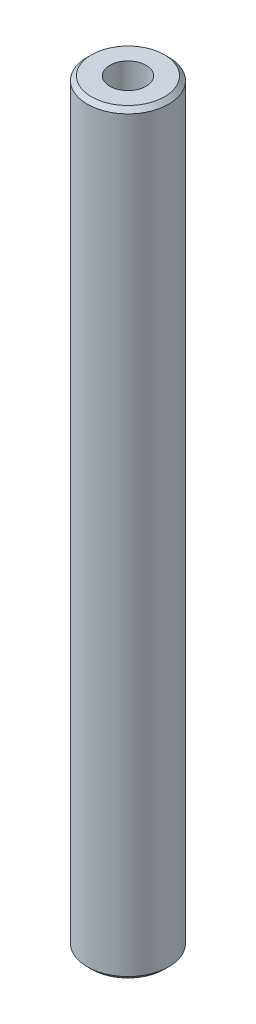
ISO-10303-21;
HEADER;
FILE_DESCRIPTION(('STEP AP214'),'2;1');
FILE_NAME('part.step','',(''),(''),'','','');
FILE_SCHEMA(('AUTOMOTIVE_DESIGN { 1 0 10303 214 1 1 1 1 }'));
ENDSEC;
DATA;
#1=APPLICATION_CONTEXT('core data for automotive mechanical design processes');
#2=APPLICATION_PROTOCOL_DEFINITION('international standard','automotive_design',2000,#1);
#3=PRODUCT_CONTEXT('',#1,'mechanical');
#4=PRODUCT('Part','Part','',(#3));
#5=PRODUCT_RELATED_PRODUCT_CATEGORY('part','',(#4));
#6=PRODUCT_DEFINITION_FORMATION('','',#4);
#7=PRODUCT_DEFINITION_CONTEXT('part definition',#1,'design');
#8=PRODUCT_DEFINITION('design','',#6,#7);
#9=PRODUCT_DEFINITION_SHAPE('','',#8);
#10=(LENGTH_UNIT() NAMED_UNIT(*) SI_UNIT(.MILLI.,.METRE.));
#11=(NAMED_UNIT(*) PLANE_ANGLE_UNIT() SI_UNIT($,.RADIAN.));
#12=(NAMED_UNIT(*) SI_UNIT($,.STERADIAN.) SOLID_ANGLE_UNIT());
#13=UNCERTAINTY_MEASURE_WITH_UNIT(LENGTH_MEASURE(1.E-05),#10,'distance_accuracy_value','');
#14=(GEOMETRIC_REPRESENTATION_CONTEXT(3) GLOBAL_UNCERTAINTY_ASSIGNED_CONTEXT((#13)) GLOBAL_UNIT_ASSIGNED_CONTEXT((#10,
#11,#12)) REPRESENTATION_CONTEXT('',''));
#15=CARTESIAN_POINT('',(0.,0.,0.));
#16=DIRECTION('',(0.,0.,1.));
#17=DIRECTION('',(1.,0.,0.));
#18=AXIS2_PLACEMENT_3D('',#15,#16,#17);
#19=CARTESIAN_POINT('',(0.,139.200493700492,0.));
#20=DIRECTION('',(0.,-1.,0.));
#21=DIRECTION('',(0.,0.,-1.));
#22=AXIS2_PLACEMENT_3D('',#19,#20,#21);
#23=CYLINDRICAL_SURFACE('',#22,7.5);
#24=CARTESIAN_POINT('',(0.,138.418108865154,0.));
#25=DIRECTION('',(0.,1.,0.));
#26=DIRECTION('',(0.,0.,1.));
#27=AXIS2_PLACEMENT_3D('',#24,#25,#26);
#28=CIRCLE('',#27,7.5);
#29=CARTESIAN_POINT('',(0.,138.418108865154,7.5));
#30=VERTEX_POINT('',#29);
#31=EDGE_CURVE('E50',#30,#30,#28,.F.);
#32=ORIENTED_EDGE('',*,*,#31,.T.);
#33=EDGE_LOOP('',(#32));
#34=FACE_BOUND('',#33,.T.);
#35=CARTESIAN_POINT('',(0.,0.782384835338296,0.));
#36=DIRECTION('',(0.,1.,0.));
#37=DIRECTION('',(0.,0.,1.));
#38=AXIS2_PLACEMENT_3D('',#35,#36,#37);
#39=CIRCLE('',#38,7.5);
#40=CARTESIAN_POINT('',(0.,0.782384835338296,7.5));
#41=VERTEX_POINT('',#40);
#42=EDGE_CURVE('E51',#41,#41,#39,.T.);
#43=ORIENTED_EDGE('',*,*,#42,.T.);
#44=EDGE_LOOP('',(#43));
#45=FACE_BOUND('',#44,.T.);
#46=ADVANCED_FACE('F39',(#34,#45),#23,.T.);
#47=CARTESIAN_POINT('',(0.,139.200493700492,0.));
#48=DIRECTION('',(0.,1.,0.));
#49=DIRECTION('',(0.,0.,1.));
#50=AXIS2_PLACEMENT_3D('',#47,#48,#49);
#51=PLANE('',#50);
#52=CARTESIAN_POINT('',(0.,139.200493700492,0.));
#53=DIRECTION('',(0.,1.,0.));
#54=DIRECTION('',(0.,0.,1.));
#55=AXIS2_PLACEMENT_3D('',#52,#53,#54);
#56=CIRCLE('',#55,6.71761516466164);
#57=CARTESIAN_POINT('',(0.,139.200493700492,6.71761516466164));
#58=VERTEX_POINT('',#57);
#59=EDGE_CURVE('E54',#58,#58,#56,.T.);
#60=ORIENTED_EDGE('',*,*,#59,.T.);
#61=EDGE_LOOP('',(#60));
#62=FACE_BOUND('',#61,.T.);
#63=CARTESIAN_POINT('',(0.,139.200493700492,0.));
#64=DIRECTION('',(0.,1.,0.));
#65=DIRECTION('',(0.,0.,1.));
#66=AXIS2_PLACEMENT_3D('',#63,#64,#65);
#67=CIRCLE('',#66,3.34863038599166);
#68=CARTESIAN_POINT('',(0.,139.200493700492,3.34863038599166));
#69=VERTEX_POINT('',#68);
#70=EDGE_CURVE('E58',#69,#69,#67,.T.);
#71=ORIENTED_EDGE('',*,*,#70,.F.);
#72=EDGE_LOOP('',(#71));
#73=FACE_BOUND('',#72,.T.);
#74=ADVANCED_FACE('F69',(#62,#73),#51,.T.);
#75=CARTESIAN_POINT('',(0.,0.,0.));
#76=DIRECTION('',(0.,1.,0.));
#77=DIRECTION('',(0.,0.,1.));
#78=AXIS2_PLACEMENT_3D('',#75,#76,#77);
#79=PLANE('',#78);
#80=CARTESIAN_POINT('',(0.,0.,0.));
#81=DIRECTION('',(0.,1.,0.));
#82=DIRECTION('',(0.,0.,1.));
#83=AXIS2_PLACEMENT_3D('',#80,#81,#82);
#84=CIRCLE('',#83,6.71761516466171);
#85=CARTESIAN_POINT('',(0.,0.,6.71761516466171));
#86=VERTEX_POINT('',#85);
#87=EDGE_CURVE('E10',#86,#86,#84,.F.);
#88=ORIENTED_EDGE('',*,*,#87,.T.);
#89=EDGE_LOOP('',(#88));
#90=FACE_BOUND('',#89,.T.);
#91=CARTESIAN_POINT('',(0.,0.,0.));
#92=DIRECTION('',(0.,1.,0.));
#93=DIRECTION('',(0.,0.,1.));
#94=AXIS2_PLACEMENT_3D('',#91,#92,#93);
#95=CIRCLE('',#94,3.34863038599166);
#96=CARTESIAN_POINT('',(0.,0.,3.34863038599166));
#97=VERTEX_POINT('',#96);
#98=EDGE_CURVE('E63',#97,#97,#95,.T.);
#99=ORIENTED_EDGE('',*,*,#98,.T.);
#100=EDGE_LOOP('',(#99));
#101=FACE_BOUND('',#100,.T.);
#102=ADVANCED_FACE('F75',(#90,#101),#79,.F.);
#103=CARTESIAN_POINT('',(0.,139.200493700492,0.));
#104=DIRECTION('',(0.,-1.,0.));
#105=DIRECTION('',(0.,0.,-1.));
#106=AXIS2_PLACEMENT_3D('',#103,#104,#105);
#107=CYLINDRICAL_SURFACE('',#106,3.34863038599166);
#108=ORIENTED_EDGE('',*,*,#70,.T.);
#109=EDGE_LOOP('',(#108));
#110=FACE_BOUND('',#109,.T.);
#111=ORIENTED_EDGE('',*,*,#98,.F.);
#112=EDGE_LOOP('',(#111));
#113=FACE_BOUND('',#112,.T.);
#114=ADVANCED_FACE('F70',(#110,#113),#107,.F.);
#115=CARTESIAN_POINT('',(0.,139.200493700492,0.));
#116=DIRECTION('',(0.,-1.,0.));
#117=DIRECTION('',(0.,0.,-1.));
#118=AXIS2_PLACEMENT_3D('',#115,#116,#117);
#119=CONICAL_SURFACE('',#118,6.71761516466164,0.785398163397435);
#120=ORIENTED_EDGE('',*,*,#31,.F.);
#121=EDGE_LOOP('',(#120));
#122=FACE_BOUND('',#121,.T.);
#123=ORIENTED_EDGE('',*,*,#59,.F.);
#124=EDGE_LOOP('',(#123));
#125=FACE_BOUND('',#124,.T.);
#126=ADVANCED_FACE('F81',(#122,#125),#119,.T.);
#127=CARTESIAN_POINT('',(0.,0.782384835338296,0.));
#128=DIRECTION('',(0.,1.,0.));
#129=DIRECTION('',(0.,0.,1.));
#130=AXIS2_PLACEMENT_3D('',#127,#128,#129);
#131=CONICAL_SURFACE('',#130,7.5,0.785398163397444);
#132=CARTESIAN_POINT('',(0.,0.,6.71761516466171));
#133=CARTESIAN_POINT('',(0.,0.00814984203477395,6.72576500669648));
#134=CARTESIAN_POINT('',(0.,0.0162996840695478,6.73391484873126));
#135=CARTESIAN_POINT('',(0.,0.0325993681390956,6.75021453280081));
#136=CARTESIAN_POINT('',(0.,0.0407492101738695,6.75836437483558));
#137=CARTESIAN_POINT('',(0.,0.0570488942434173,6.77466405890513));
#138=CARTESIAN_POINT('',(0.,0.0651987362781912,6.7828139009399));
#139=CARTESIAN_POINT('',(0.,0.081498420347739,6.79911358500945));
#140=CARTESIAN_POINT('',(0.,0.0896482623825128,6.80726342704422));
#141=CARTESIAN_POINT('',(0.,0.105947946452061,6.82356311111377));
#142=CARTESIAN_POINT('',(0.,0.114097788486835,6.83171295314854));
#143=CARTESIAN_POINT('',(0.,0.130397472556383,6.84801263721809));
#144=CARTESIAN_POINT('',(0.,0.138547314591156,6.85616247925287));
#145=CARTESIAN_POINT('',(0.,0.154846998660704,6.87246216332241));
#146=CARTESIAN_POINT('',(0.,0.162996840695478,6.88061200535719));
#147=CARTESIAN_POINT('',(0.,0.179296524765026,6.89691168942674));
#148=CARTESIAN_POINT('',(0.,0.1874463667998,6.90506153146151));
#149=CARTESIAN_POINT('',(0.,0.203746050869348,6.92136121553106));
#150=CARTESIAN_POINT('',(0.,0.211895892904122,6.92951105756583));
#151=CARTESIAN_POINT('',(0.,0.22819557697367,6.94581074163538));
#152=CARTESIAN_POINT('',(0.,0.236345419008443,6.95396058367015));
#153=CARTESIAN_POINT('',(0.,0.252645103077991,6.9702602677397));
#154=CARTESIAN_POINT('',(0.,0.260794945112765,6.97841010977447));
#155=CARTESIAN_POINT('',(0.,0.277094629182313,6.99470979384402));
#156=CARTESIAN_POINT('',(0.,0.285244471217087,7.00285963587879));
#157=CARTESIAN_POINT('',(0.,0.301544155286635,7.01915931994834));
#158=CARTESIAN_POINT('',(0.,0.309693997321409,7.02730916198312));
#159=CARTESIAN_POINT('',(0.,0.325993681390956,7.04360884605266));
#160=CARTESIAN_POINT('',(0.,0.33414352342573,7.05175868808744));
#161=CARTESIAN_POINT('',(0.,0.350443207495278,7.06805837215699));
#162=CARTESIAN_POINT('',(0.,0.358593049530052,7.07620821419176));
#163=CARTESIAN_POINT('',(0.,0.3748927335996,7.09250789826131));
#164=CARTESIAN_POINT('',(0.,0.383042575634374,7.10065774029608));
#165=CARTESIAN_POINT('',(0.,0.399342259703922,7.11695742436563));
#166=CARTESIAN_POINT('',(0.,0.407492101738696,7.1251072664004));
#167=CARTESIAN_POINT('',(0.,0.423791785808243,7.14140695046995));
#168=CARTESIAN_POINT('',(0.,0.431941627843017,7.14955679250472));
#169=CARTESIAN_POINT('',(0.,0.448241311912565,7.16585647657427));
#170=CARTESIAN_POINT('',(0.,0.456391153947339,7.17400631860905));
#171=CARTESIAN_POINT('',(0.,0.472690838016887,7.19030600267859));
#172=CARTESIAN_POINT('',(0.,0.480840680051661,7.19845584471337));
#173=CARTESIAN_POINT('',(0.,0.497140364121209,7.21475552878292));
#174=CARTESIAN_POINT('',(0.,0.505290206155983,7.22290537081769));
#175=CARTESIAN_POINT('',(0.,0.52158989022553,7.23920505488724));
#176=CARTESIAN_POINT('',(0.,0.529739732260304,7.24735489692201));
#177=CARTESIAN_POINT('',(0.,0.546039416329852,7.26365458099156));
#178=CARTESIAN_POINT('',(0.,0.554189258364626,7.27180442302633));
#179=CARTESIAN_POINT('',(0.,0.570488942434174,7.28810410709588));
#180=CARTESIAN_POINT('',(0.,0.578638784468948,7.29625394913065));
#181=CARTESIAN_POINT('',(0.,0.594938468538496,7.3125536332002));
#182=CARTESIAN_POINT('',(0.,0.603088310573269,7.32070347523497));
#183=CARTESIAN_POINT('',(0.,0.619387994642817,7.33700315930452));
#184=CARTESIAN_POINT('',(0.,0.627537836677591,7.3451530013393));
#185=CARTESIAN_POINT('',(0.,0.643837520747139,7.36145268540884));
#186=CARTESIAN_POINT('',(0.,0.651987362781913,7.36960252744362));
#187=CARTESIAN_POINT('',(0.,0.668287046851461,7.38590221151317));
#188=CARTESIAN_POINT('',(0.,0.676436888886235,7.39405205354794));
#189=CARTESIAN_POINT('',(0.,0.692736572955782,7.41035173761749));
#190=CARTESIAN_POINT('',(0.,0.700886414990556,7.41850157965226));
#191=CARTESIAN_POINT('',(0.,0.717186099060104,7.43480126372181));
#192=CARTESIAN_POINT('',(0.,0.725335941094878,7.44295110575658));
#193=CARTESIAN_POINT('',(0.,0.741635625164426,7.45925078982613));
#194=CARTESIAN_POINT('',(0.,0.7497854671992,7.4674006318609));
#195=CARTESIAN_POINT('',(0.,0.766085151268748,7.48370031593045));
#196=CARTESIAN_POINT('',(0.,0.774234993303522,7.49185015796523));
#197=CARTESIAN_POINT('',(0.,0.782384835338296,7.5));
#198=B_SPLINE_CURVE_WITH_KNOTS('',3,(#132,#133,#134,#135,#136,#137,#138,#139,#140,#141,#142,
#143,#144,#145,#146,#147,#148,#149,#150,#151,#152,#153,#154,#155,#156,#157,#158,#159,#160,#161,
#162,#163,#164,#165,#166,#167,#168,#169,#170,#171,#172,#173,#174,#175,#176,#177,#178,#179,#180,
#181,#182,#183,#184,#185,#186,#187,#188,#189,#190,#191,#192,#193,#194,#195,#196,#197),
.UNSPECIFIED.,.F.,.F.,(4,2,2,2,2,2,2,2,2,2,2,2,2,2,2,2,2,2,2,2,2,2,2,2,2,2,2,2,2,2,2,2,4),(0.,
0.0345768514103262,0.069153702820653,0.10373055423098,0.138307405641307,0.172884257051633,
0.20746110846196,0.242037959872287,0.276614811282613,0.31119166269294,0.345768514103266,
0.380345365513593,0.41492221692392,0.449499068334247,0.484075919744573,0.5186527711549,
0.553229622565227,0.587806473975553,0.62238332538588,0.656960176796207,0.691537028206533,
0.72611387961686,0.760690731027186,0.795267582437513,0.82984443384784,0.864421285258167,
0.898998136668493,0.93357498807882,0.968151839489147,1.00272869089947,1.0373055423098,
1.07188239372013,1.10645924513045),.UNSPECIFIED.);
#199=EDGE_CURVE('BSEAM45',#86,#41,#198,.T.);
#200=ORIENTED_EDGE('',*,*,#87,.F.);
#201=ORIENTED_EDGE('',*,*,#42,.F.);
#202=ORIENTED_EDGE('',*,*,#199,.T.);
#203=ORIENTED_EDGE('',*,*,#199,.F.);
#204=EDGE_LOOP('',(#200,#202,#201,#203));
#205=FACE_BOUND('',#204,.T.);
#206=ADVANCED_FACE('F45',(#205),#131,.T.);
#207=CLOSED_SHELL('',(#46,#74,#102,#114,#126,#206));
#208=MANIFOLD_SOLID_BREP('B2',#207);
#209=ADVANCED_BREP_SHAPE_REPRESENTATION('',(#18,#208),#14);
#210=SHAPE_DEFINITION_REPRESENTATION(#9,#209);
ENDSEC;
END-ISO-10303-21;
